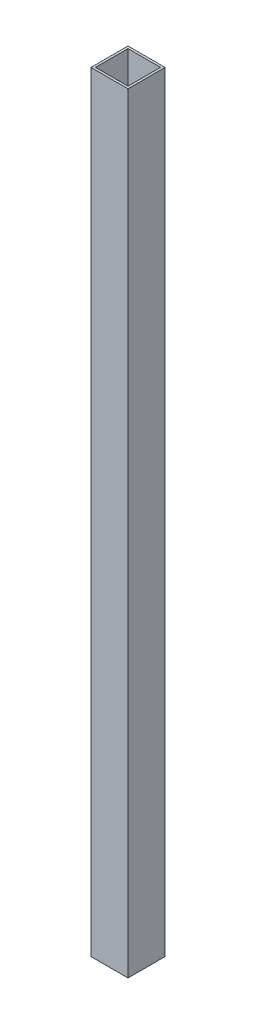
ISO-10303-21;
HEADER;
FILE_DESCRIPTION(('STEP AP214'),'2;1');
FILE_NAME('part.step','',(''),(''),'','','');
FILE_SCHEMA(('AUTOMOTIVE_DESIGN { 1 0 10303 214 1 1 1 1 }'));
ENDSEC;
DATA;
#1=APPLICATION_CONTEXT('core data for automotive mechanical design processes');
#2=APPLICATION_PROTOCOL_DEFINITION('international standard','automotive_design',2000,#1);
#3=PRODUCT_CONTEXT('',#1,'mechanical');
#4=PRODUCT('Part','Part','',(#3));
#5=PRODUCT_RELATED_PRODUCT_CATEGORY('part','',(#4));
#6=PRODUCT_DEFINITION_FORMATION('','',#4);
#7=PRODUCT_DEFINITION_CONTEXT('part definition',#1,'design');
#8=PRODUCT_DEFINITION('design','',#6,#7);
#9=PRODUCT_DEFINITION_SHAPE('','',#8);
#10=(LENGTH_UNIT() NAMED_UNIT(*) SI_UNIT(.MILLI.,.METRE.));
#11=(NAMED_UNIT(*) PLANE_ANGLE_UNIT() SI_UNIT($,.RADIAN.));
#12=(NAMED_UNIT(*) SI_UNIT($,.STERADIAN.) SOLID_ANGLE_UNIT());
#13=UNCERTAINTY_MEASURE_WITH_UNIT(LENGTH_MEASURE(1.E-05),#10,'distance_accuracy_value','');
#14=(GEOMETRIC_REPRESENTATION_CONTEXT(3) GLOBAL_UNCERTAINTY_ASSIGNED_CONTEXT((#13)) GLOBAL_UNIT_ASSIGNED_CONTEXT((#10,
#11,#12)) REPRESENTATION_CONTEXT('',''));
#15=CARTESIAN_POINT('',(0.,0.,0.));
#16=DIRECTION('',(0.,0.,1.));
#17=DIRECTION('',(1.,0.,0.));
#18=AXIS2_PLACEMENT_3D('',#15,#16,#17);
#19=CARTESIAN_POINT('',(0.,528.32,0.));
#20=DIRECTION('',(0.,1.,0.));
#21=DIRECTION('',(0.,0.,1.));
#22=AXIS2_PLACEMENT_3D('',#19,#20,#21);
#23=PLANE('',#22);
#24=DIRECTION('',(0.,0.,1.));
#25=VECTOR('',#24,1.);
#26=CARTESIAN_POINT('',(-33.3375,528.32,-19.446875));
#27=LINE('',#26,#25);
#28=CARTESIAN_POINT('',(-33.3375,528.32,-19.446875));
#29=VERTEX_POINT('',#28);
#30=CARTESIAN_POINT('',(-33.3375,528.32,5.95312500000003));
#31=VERTEX_POINT('',#30);
#32=EDGE_CURVE('E134',#29,#31,#27,.T.);
#33=ORIENTED_EDGE('',*,*,#32,.T.);
#34=DIRECTION('',(1.,0.,0.));
#35=VECTOR('',#34,1.);
#36=CARTESIAN_POINT('',(-33.3375,528.32,5.95312500000003));
#37=LINE('',#36,#35);
#38=CARTESIAN_POINT('',(-7.93749999999997,528.32,5.95312500000003));
#39=VERTEX_POINT('',#38);
#40=EDGE_CURVE('E137',#31,#39,#37,.T.);
#41=ORIENTED_EDGE('',*,*,#40,.T.);
#42=DIRECTION('',(0.,0.,-1.));
#43=VECTOR('',#42,1.);
#44=CARTESIAN_POINT('',(-7.93749999999997,528.32,-19.446875));
#45=LINE('',#44,#43);
#46=CARTESIAN_POINT('',(-7.93749999999997,528.32,-19.446875));
#47=VERTEX_POINT('',#46);
#48=EDGE_CURVE('E140',#39,#47,#45,.T.);
#49=ORIENTED_EDGE('',*,*,#48,.T.);
#50=DIRECTION('',(-1.,0.,0.));
#51=VECTOR('',#50,1.);
#52=CARTESIAN_POINT('',(-33.3375,528.32,-19.446875));
#53=LINE('',#52,#51);
#54=EDGE_CURVE('E142',#47,#29,#53,.T.);
#55=ORIENTED_EDGE('',*,*,#54,.T.);
#56=EDGE_LOOP('',(#33,#41,#49,#55));
#57=FACE_BOUND('',#56,.T.);
#58=DIRECTION('',(1.,0.,0.));
#59=VECTOR('',#58,1.);
#60=CARTESIAN_POINT('',(-31.8135,528.32,4.42912500000003));
#61=LINE('',#60,#59);
#62=CARTESIAN_POINT('',(-31.8135,528.32,4.42912500000003));
#63=VERTEX_POINT('',#62);
#64=CARTESIAN_POINT('',(-9.46149999999997,528.32,4.42912500000003));
#65=VERTEX_POINT('',#64);
#66=EDGE_CURVE('E106',#63,#65,#61,.T.);
#67=ORIENTED_EDGE('',*,*,#66,.F.);
#68=DIRECTION('',(0.,0.,1.));
#69=VECTOR('',#68,1.);
#70=CARTESIAN_POINT('',(-31.8135,528.32,-17.922875));
#71=LINE('',#70,#69);
#72=CARTESIAN_POINT('',(-31.8135,528.32,-17.922875));
#73=VERTEX_POINT('',#72);
#74=EDGE_CURVE('E98',#73,#63,#71,.T.);
#75=ORIENTED_EDGE('',*,*,#74,.F.);
#76=DIRECTION('',(-1.,0.,0.));
#77=VECTOR('',#76,1.);
#78=CARTESIAN_POINT('',(-31.8135,528.32,-17.922875));
#79=LINE('',#78,#77);
#80=CARTESIAN_POINT('',(-9.46149999999997,528.32,-17.922875));
#81=VERTEX_POINT('',#80);
#82=EDGE_CURVE('E120',#81,#73,#79,.T.);
#83=ORIENTED_EDGE('',*,*,#82,.F.);
#84=DIRECTION('',(0.,0.,-1.));
#85=VECTOR('',#84,1.);
#86=CARTESIAN_POINT('',(-9.46149999999997,528.32,-17.922875));
#87=LINE('',#86,#85);
#88=EDGE_CURVE('E118',#65,#81,#87,.T.);
#89=ORIENTED_EDGE('',*,*,#88,.F.);
#90=EDGE_LOOP('',(#67,#75,#83,#89));
#91=FACE_BOUND('',#90,.T.);
#92=ADVANCED_FACE('F33',(#57,#91),#23,.T.);
#93=CARTESIAN_POINT('',(0.,0.,0.));
#94=DIRECTION('',(0.,1.,0.));
#95=DIRECTION('',(0.,0.,1.));
#96=AXIS2_PLACEMENT_3D('',#93,#94,#95);
#97=PLANE('',#96);
#98=DIRECTION('',(0.,0.,1.));
#99=VECTOR('',#98,1.);
#100=CARTESIAN_POINT('',(-33.3375,0.,-19.446875));
#101=LINE('',#100,#99);
#102=CARTESIAN_POINT('',(-33.3375,0.,-19.446875));
#103=VERTEX_POINT('',#102);
#104=CARTESIAN_POINT('',(-33.3375,0.,5.95312500000003));
#105=VERTEX_POINT('',#104);
#106=EDGE_CURVE('E114',#103,#105,#101,.T.);
#107=ORIENTED_EDGE('',*,*,#106,.F.);
#108=DIRECTION('',(-1.,0.,0.));
#109=VECTOR('',#108,1.);
#110=CARTESIAN_POINT('',(-33.3375,0.,-19.446875));
#111=LINE('',#110,#109);
#112=CARTESIAN_POINT('',(-7.93749999999997,0.,-19.446875));
#113=VERTEX_POINT('',#112);
#114=EDGE_CURVE('E138',#113,#103,#111,.T.);
#115=ORIENTED_EDGE('',*,*,#114,.F.);
#116=DIRECTION('',(0.,0.,-1.));
#117=VECTOR('',#116,1.);
#118=CARTESIAN_POINT('',(-7.93749999999997,0.,-19.446875));
#119=LINE('',#118,#117);
#120=CARTESIAN_POINT('',(-7.93749999999997,0.,5.95312500000003));
#121=VERTEX_POINT('',#120);
#122=EDGE_CURVE('E149',#121,#113,#119,.T.);
#123=ORIENTED_EDGE('',*,*,#122,.F.);
#124=DIRECTION('',(1.,0.,0.));
#125=VECTOR('',#124,1.);
#126=CARTESIAN_POINT('',(-33.3375,0.,5.95312500000003));
#127=LINE('',#126,#125);
#128=EDGE_CURVE('E147',#105,#121,#127,.T.);
#129=ORIENTED_EDGE('',*,*,#128,.F.);
#130=EDGE_LOOP('',(#107,#115,#123,#129));
#131=FACE_BOUND('',#130,.T.);
#132=DIRECTION('',(0.,0.,1.));
#133=VECTOR('',#132,1.);
#134=CARTESIAN_POINT('',(-31.8135,0.,-17.922875));
#135=LINE('',#134,#133);
#136=CARTESIAN_POINT('',(-31.8135,0.,-17.922875));
#137=VERTEX_POINT('',#136);
#138=CARTESIAN_POINT('',(-31.8135,0.,4.42912500000003));
#139=VERTEX_POINT('',#138);
#140=EDGE_CURVE('E56',#137,#139,#135,.T.);
#141=ORIENTED_EDGE('',*,*,#140,.T.);
#142=DIRECTION('',(1.,0.,0.));
#143=VECTOR('',#142,1.);
#144=CARTESIAN_POINT('',(-31.8135,0.,4.42912500000003));
#145=LINE('',#144,#143);
#146=CARTESIAN_POINT('',(-9.46149999999997,0.,4.42912500000003));
#147=VERTEX_POINT('',#146);
#148=EDGE_CURVE('E113',#139,#147,#145,.T.);
#149=ORIENTED_EDGE('',*,*,#148,.T.);
#150=DIRECTION('',(0.,0.,-1.));
#151=VECTOR('',#150,1.);
#152=CARTESIAN_POINT('',(-9.46149999999997,0.,-17.922875));
#153=LINE('',#152,#151);
#154=CARTESIAN_POINT('',(-9.46149999999997,0.,-17.922875));
#155=VERTEX_POINT('',#154);
#156=EDGE_CURVE('E126',#147,#155,#153,.T.);
#157=ORIENTED_EDGE('',*,*,#156,.T.);
#158=DIRECTION('',(-1.,0.,0.));
#159=VECTOR('',#158,1.);
#160=CARTESIAN_POINT('',(-31.8135,0.,-17.922875));
#161=LINE('',#160,#159);
#162=EDGE_CURVE('E107',#155,#137,#161,.T.);
#163=ORIENTED_EDGE('',*,*,#162,.T.);
#164=EDGE_LOOP('',(#141,#149,#157,#163));
#165=FACE_BOUND('',#164,.T.);
#166=ADVANCED_FACE('F167',(#131,#165),#97,.F.);
#167=CARTESIAN_POINT('',(-33.3375,528.32,-19.446875));
#168=DIRECTION('',(1.,0.,0.));
#169=DIRECTION('',(0.,0.,-1.));
#170=AXIS2_PLACEMENT_3D('',#167,#168,#169);
#171=PLANE('',#170);
#172=ORIENTED_EDGE('',*,*,#106,.T.);
#173=DIRECTION('',(0.,-1.,0.));
#174=VECTOR('',#173,1.);
#175=CARTESIAN_POINT('',(-33.3375,528.32,5.95312500000003));
#176=LINE('',#175,#174);
#177=EDGE_CURVE('E11',#31,#105,#176,.T.);
#178=ORIENTED_EDGE('',*,*,#177,.F.);
#179=ORIENTED_EDGE('',*,*,#32,.F.);
#180=DIRECTION('',(0.,-1.,0.));
#181=VECTOR('',#180,1.);
#182=CARTESIAN_POINT('',(-33.3375,528.32,-19.446875));
#183=LINE('',#182,#181);
#184=EDGE_CURVE('E144',#29,#103,#183,.T.);
#185=ORIENTED_EDGE('',*,*,#184,.T.);
#186=EDGE_LOOP('',(#172,#178,#179,#185));
#187=FACE_BOUND('',#186,.T.);
#188=ADVANCED_FACE('F35',(#187),#171,.F.);
#189=CARTESIAN_POINT('',(-33.3375,528.32,5.95312500000003));
#190=DIRECTION('',(0.,0.,-1.));
#191=DIRECTION('',(-1.,0.,0.));
#192=AXIS2_PLACEMENT_3D('',#189,#190,#191);
#193=PLANE('',#192);
#194=ORIENTED_EDGE('',*,*,#128,.T.);
#195=DIRECTION('',(0.,-1.,0.));
#196=VECTOR('',#195,1.);
#197=CARTESIAN_POINT('',(-7.93749999999997,528.32,5.95312500000003));
#198=LINE('',#197,#196);
#199=EDGE_CURVE('E41',#39,#121,#198,.T.);
#200=ORIENTED_EDGE('',*,*,#199,.F.);
#201=ORIENTED_EDGE('',*,*,#40,.F.);
#202=ORIENTED_EDGE('',*,*,#177,.T.);
#203=EDGE_LOOP('',(#194,#200,#201,#202));
#204=FACE_BOUND('',#203,.T.);
#205=ADVANCED_FACE('F177',(#204),#193,.F.);
#206=CARTESIAN_POINT('',(-7.93749999999997,528.32,-19.446875));
#207=DIRECTION('',(-1.,0.,0.));
#208=DIRECTION('',(0.,0.,1.));
#209=AXIS2_PLACEMENT_3D('',#206,#207,#208);
#210=PLANE('',#209);
#211=ORIENTED_EDGE('',*,*,#122,.T.);
#212=DIRECTION('',(0.,-1.,0.));
#213=VECTOR('',#212,1.);
#214=CARTESIAN_POINT('',(-7.93749999999997,528.32,-19.446875));
#215=LINE('',#214,#213);
#216=EDGE_CURVE('E154',#47,#113,#215,.T.);
#217=ORIENTED_EDGE('',*,*,#216,.F.);
#218=ORIENTED_EDGE('',*,*,#48,.F.);
#219=ORIENTED_EDGE('',*,*,#199,.T.);
#220=EDGE_LOOP('',(#211,#217,#218,#219));
#221=FACE_BOUND('',#220,.T.);
#222=ADVANCED_FACE('F161',(#221),#210,.F.);
#223=CARTESIAN_POINT('',(-33.3375,528.32,-19.446875));
#224=DIRECTION('',(0.,0.,1.));
#225=DIRECTION('',(1.,0.,0.));
#226=AXIS2_PLACEMENT_3D('',#223,#224,#225);
#227=PLANE('',#226);
#228=ORIENTED_EDGE('',*,*,#114,.T.);
#229=ORIENTED_EDGE('',*,*,#184,.F.);
#230=ORIENTED_EDGE('',*,*,#54,.F.);
#231=ORIENTED_EDGE('',*,*,#216,.T.);
#232=EDGE_LOOP('',(#228,#229,#230,#231));
#233=FACE_BOUND('',#232,.T.);
#234=ADVANCED_FACE('F171',(#233),#227,.F.);
#235=CARTESIAN_POINT('',(-31.8135,528.32,-17.922875));
#236=DIRECTION('',(1.,0.,0.));
#237=DIRECTION('',(0.,0.,-1.));
#238=AXIS2_PLACEMENT_3D('',#235,#236,#237);
#239=PLANE('',#238);
#240=ORIENTED_EDGE('',*,*,#140,.F.);
#241=DIRECTION('',(0.,-1.,0.));
#242=VECTOR('',#241,1.);
#243=CARTESIAN_POINT('',(-31.8135,528.32,-17.922875));
#244=LINE('',#243,#242);
#245=EDGE_CURVE('E102',#73,#137,#244,.T.);
#246=ORIENTED_EDGE('',*,*,#245,.F.);
#247=ORIENTED_EDGE('',*,*,#74,.T.);
#248=DIRECTION('',(0.,-1.,0.));
#249=VECTOR('',#248,1.);
#250=CARTESIAN_POINT('',(-31.8135,528.32,4.42912500000003));
#251=LINE('',#250,#249);
#252=EDGE_CURVE('E101',#63,#139,#251,.T.);
#253=ORIENTED_EDGE('',*,*,#252,.T.);
#254=EDGE_LOOP('',(#240,#246,#247,#253));
#255=FACE_BOUND('',#254,.T.);
#256=ADVANCED_FACE('F100',(#255),#239,.T.);
#257=CARTESIAN_POINT('',(-31.8135,528.32,4.42912500000003));
#258=DIRECTION('',(0.,0.,-1.));
#259=DIRECTION('',(-1.,0.,0.));
#260=AXIS2_PLACEMENT_3D('',#257,#258,#259);
#261=PLANE('',#260);
#262=ORIENTED_EDGE('',*,*,#148,.F.);
#263=ORIENTED_EDGE('',*,*,#252,.F.);
#264=ORIENTED_EDGE('',*,*,#66,.T.);
#265=DIRECTION('',(0.,-1.,0.));
#266=VECTOR('',#265,1.);
#267=CARTESIAN_POINT('',(-9.46149999999997,528.32,4.42912500000003));
#268=LINE('',#267,#266);
#269=EDGE_CURVE('E115',#65,#147,#268,.T.);
#270=ORIENTED_EDGE('',*,*,#269,.T.);
#271=EDGE_LOOP('',(#262,#263,#264,#270));
#272=FACE_BOUND('',#271,.T.);
#273=ADVANCED_FACE('F110',(#272),#261,.T.);
#274=CARTESIAN_POINT('',(-9.46149999999997,528.32,-17.922875));
#275=DIRECTION('',(-1.,0.,0.));
#276=DIRECTION('',(0.,0.,1.));
#277=AXIS2_PLACEMENT_3D('',#274,#275,#276);
#278=PLANE('',#277);
#279=ORIENTED_EDGE('',*,*,#156,.F.);
#280=ORIENTED_EDGE('',*,*,#269,.F.);
#281=ORIENTED_EDGE('',*,*,#88,.T.);
#282=DIRECTION('',(0.,-1.,0.));
#283=VECTOR('',#282,1.);
#284=CARTESIAN_POINT('',(-9.46149999999997,528.32,-17.922875));
#285=LINE('',#284,#283);
#286=EDGE_CURVE('E48',#81,#155,#285,.T.);
#287=ORIENTED_EDGE('',*,*,#286,.T.);
#288=EDGE_LOOP('',(#279,#280,#281,#287));
#289=FACE_BOUND('',#288,.T.);
#290=ADVANCED_FACE('F200',(#289),#278,.T.);
#291=CARTESIAN_POINT('',(-31.8135,528.32,-17.922875));
#292=DIRECTION('',(0.,0.,1.));
#293=DIRECTION('',(1.,0.,0.));
#294=AXIS2_PLACEMENT_3D('',#291,#292,#293);
#295=PLANE('',#294);
#296=ORIENTED_EDGE('',*,*,#162,.F.);
#297=ORIENTED_EDGE('',*,*,#286,.F.);
#298=ORIENTED_EDGE('',*,*,#82,.T.);
#299=ORIENTED_EDGE('',*,*,#245,.T.);
#300=EDGE_LOOP('',(#296,#297,#298,#299));
#301=FACE_BOUND('',#300,.T.);
#302=ADVANCED_FACE('F204',(#301),#295,.T.);
#303=CLOSED_SHELL('',(#92,#166,#188,#205,#222,#234,#256,#273,#290,#302));
#304=MANIFOLD_SOLID_BREP('B2',#303);
#305=ADVANCED_BREP_SHAPE_REPRESENTATION('',(#18,#304),#14);
#306=SHAPE_DEFINITION_REPRESENTATION(#9,#305);
ENDSEC;
END-ISO-10303-21;
